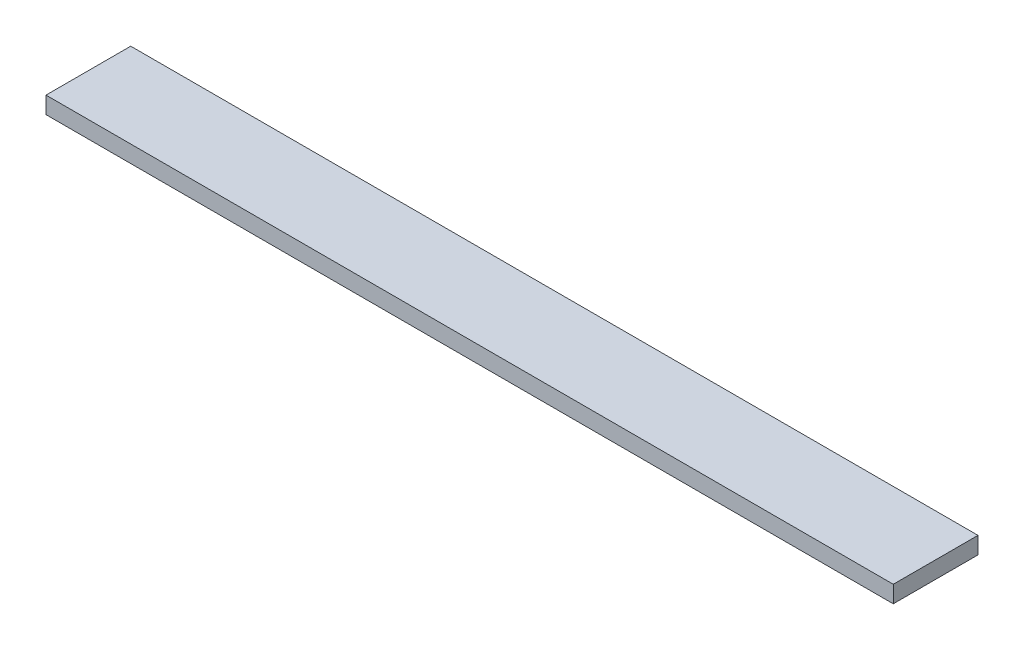
ISO-10303-21;
HEADER;
FILE_DESCRIPTION(('STEP AP214'),'2;1');
FILE_NAME('part.step','',(''),(''),'','','');
FILE_SCHEMA(('AUTOMOTIVE_DESIGN { 1 0 10303 214 1 1 1 1 }'));
ENDSEC;
DATA;
#1=APPLICATION_CONTEXT('core data for automotive mechanical design processes');
#2=APPLICATION_PROTOCOL_DEFINITION('international standard','automotive_design',2000,#1);
#3=PRODUCT_CONTEXT('',#1,'mechanical');
#4=PRODUCT('Part','Part','',(#3));
#5=PRODUCT_RELATED_PRODUCT_CATEGORY('part','',(#4));
#6=PRODUCT_DEFINITION_FORMATION('','',#4);
#7=PRODUCT_DEFINITION_CONTEXT('part definition',#1,'design');
#8=PRODUCT_DEFINITION('design','',#6,#7);
#9=PRODUCT_DEFINITION_SHAPE('','',#8);
#10=(LENGTH_UNIT() NAMED_UNIT(*) SI_UNIT(.MILLI.,.METRE.));
#11=(NAMED_UNIT(*) PLANE_ANGLE_UNIT() SI_UNIT($,.RADIAN.));
#12=(NAMED_UNIT(*) SI_UNIT($,.STERADIAN.) SOLID_ANGLE_UNIT());
#13=UNCERTAINTY_MEASURE_WITH_UNIT(LENGTH_MEASURE(1.E-05),#10,'distance_accuracy_value','');
#14=(GEOMETRIC_REPRESENTATION_CONTEXT(3) GLOBAL_UNCERTAINTY_ASSIGNED_CONTEXT((#13)) GLOBAL_UNIT_ASSIGNED_CONTEXT((#10,
#11,#12)) REPRESENTATION_CONTEXT('',''));
#15=CARTESIAN_POINT('',(0.,0.,0.));
#16=DIRECTION('',(0.,0.,1.));
#17=DIRECTION('',(1.,0.,0.));
#18=AXIS2_PLACEMENT_3D('',#15,#16,#17);
#19=CARTESIAN_POINT('',(200.,0.,0.));
#20=DIRECTION('',(0.,0.,-1.));
#21=DIRECTION('',(-1.,0.,0.));
#22=AXIS2_PLACEMENT_3D('',#19,#20,#21);
#23=PLANE('',#22);
#24=DIRECTION('',(0.,-1.,0.));
#25=VECTOR('',#24,1.);
#26=CARTESIAN_POINT('',(0.,0.,0.));
#27=LINE('',#26,#25);
#28=CARTESIAN_POINT('',(0.,4.,0.));
#29=VERTEX_POINT('',#28);
#30=CARTESIAN_POINT('',(0.,0.,0.));
#31=VERTEX_POINT('',#30);
#32=EDGE_CURVE('E97',#29,#31,#27,.T.);
#33=ORIENTED_EDGE('',*,*,#32,.T.);
#34=DIRECTION('',(-1.,0.,0.));
#35=VECTOR('',#34,1.);
#36=CARTESIAN_POINT('',(200.,0.,0.));
#37=LINE('',#36,#35);
#38=CARTESIAN_POINT('',(200.,0.,0.));
#39=VERTEX_POINT('',#38);
#40=EDGE_CURVE('E11',#39,#31,#37,.T.);
#41=ORIENTED_EDGE('',*,*,#40,.F.);
#42=DIRECTION('',(0.,-1.,0.));
#43=VECTOR('',#42,1.);
#44=CARTESIAN_POINT('',(200.,0.,0.));
#45=LINE('',#44,#43);
#46=CARTESIAN_POINT('',(200.,4.,0.));
#47=VERTEX_POINT('',#46);
#48=EDGE_CURVE('E85',#47,#39,#45,.T.);
#49=ORIENTED_EDGE('',*,*,#48,.F.);
#50=DIRECTION('',(-1.,0.,0.));
#51=VECTOR('',#50,1.);
#52=CARTESIAN_POINT('',(200.,4.,0.));
#53=LINE('',#52,#51);
#54=EDGE_CURVE('E93',#47,#29,#53,.T.);
#55=ORIENTED_EDGE('',*,*,#54,.T.);
#56=EDGE_LOOP('',(#33,#41,#49,#55));
#57=FACE_BOUND('',#56,.T.);
#58=ADVANCED_FACE('F34',(#57),#23,.F.);
#59=CARTESIAN_POINT('',(200.,0.,0.));
#60=DIRECTION('',(0.,1.,0.));
#61=DIRECTION('',(0.,0.,1.));
#62=AXIS2_PLACEMENT_3D('',#59,#60,#61);
#63=PLANE('',#62);
#64=DIRECTION('',(0.,0.,-1.));
#65=VECTOR('',#64,1.);
#66=CARTESIAN_POINT('',(0.,0.,0.));
#67=LINE('',#66,#65);
#68=CARTESIAN_POINT('',(0.,0.,-20.));
#69=VERTEX_POINT('',#68);
#70=EDGE_CURVE('E89',#31,#69,#67,.T.);
#71=ORIENTED_EDGE('',*,*,#70,.T.);
#72=DIRECTION('',(-1.,0.,0.));
#73=VECTOR('',#72,1.);
#74=CARTESIAN_POINT('',(200.,0.,-20.));
#75=LINE('',#74,#73);
#76=CARTESIAN_POINT('',(200.,0.,-20.));
#77=VERTEX_POINT('',#76);
#78=EDGE_CURVE('E42',#77,#69,#75,.T.);
#79=ORIENTED_EDGE('',*,*,#78,.F.);
#80=DIRECTION('',(0.,0.,-1.));
#81=VECTOR('',#80,1.);
#82=CARTESIAN_POINT('',(200.,0.,0.));
#83=LINE('',#82,#81);
#84=EDGE_CURVE('E80',#39,#77,#83,.T.);
#85=ORIENTED_EDGE('',*,*,#84,.F.);
#86=ORIENTED_EDGE('',*,*,#40,.T.);
#87=EDGE_LOOP('',(#71,#79,#85,#86));
#88=FACE_BOUND('',#87,.T.);
#89=ADVANCED_FACE('F88',(#88),#63,.F.);
#90=CARTESIAN_POINT('',(200.,0.,-20.));
#91=DIRECTION('',(0.,0.,1.));
#92=DIRECTION('',(1.,0.,0.));
#93=AXIS2_PLACEMENT_3D('',#90,#91,#92);
#94=PLANE('',#93);
#95=DIRECTION('',(0.,1.,0.));
#96=VECTOR('',#95,1.);
#97=CARTESIAN_POINT('',(0.,0.,-20.));
#98=LINE('',#97,#96);
#99=CARTESIAN_POINT('',(0.,4.,-20.));
#100=VERTEX_POINT('',#99);
#101=EDGE_CURVE('E67',#69,#100,#98,.T.);
#102=ORIENTED_EDGE('',*,*,#101,.T.);
#103=DIRECTION('',(-1.,0.,0.));
#104=VECTOR('',#103,1.);
#105=CARTESIAN_POINT('',(200.,4.,-20.));
#106=LINE('',#105,#104);
#107=CARTESIAN_POINT('',(200.,4.,-20.));
#108=VERTEX_POINT('',#107);
#109=EDGE_CURVE('E90',#108,#100,#106,.T.);
#110=ORIENTED_EDGE('',*,*,#109,.F.);
#111=DIRECTION('',(0.,1.,0.));
#112=VECTOR('',#111,1.);
#113=CARTESIAN_POINT('',(200.,0.,-20.));
#114=LINE('',#113,#112);
#115=EDGE_CURVE('E83',#77,#108,#114,.T.);
#116=ORIENTED_EDGE('',*,*,#115,.F.);
#117=ORIENTED_EDGE('',*,*,#78,.T.);
#118=EDGE_LOOP('',(#102,#110,#116,#117));
#119=FACE_BOUND('',#118,.T.);
#120=ADVANCED_FACE('F91',(#119),#94,.F.);
#121=CARTESIAN_POINT('',(200.,4.,0.));
#122=DIRECTION('',(0.,-1.,0.));
#123=DIRECTION('',(0.,0.,-1.));
#124=AXIS2_PLACEMENT_3D('',#121,#122,#123);
#125=PLANE('',#124);
#126=DIRECTION('',(0.,0.,1.));
#127=VECTOR('',#126,1.);
#128=CARTESIAN_POINT('',(0.,4.,0.));
#129=LINE('',#128,#127);
#130=EDGE_CURVE('E73',#100,#29,#129,.T.);
#131=ORIENTED_EDGE('',*,*,#130,.T.);
#132=ORIENTED_EDGE('',*,*,#54,.F.);
#133=DIRECTION('',(0.,0.,1.));
#134=VECTOR('',#133,1.);
#135=CARTESIAN_POINT('',(200.,4.,0.));
#136=LINE('',#135,#134);
#137=EDGE_CURVE('E50',#108,#47,#136,.T.);
#138=ORIENTED_EDGE('',*,*,#137,.F.);
#139=ORIENTED_EDGE('',*,*,#109,.T.);
#140=EDGE_LOOP('',(#131,#132,#138,#139));
#141=FACE_BOUND('',#140,.T.);
#142=ADVANCED_FACE('F104',(#141),#125,.F.);
#143=CARTESIAN_POINT('',(200.,0.,0.));
#144=DIRECTION('',(-1.,0.,0.));
#145=DIRECTION('',(0.,0.,1.));
#146=AXIS2_PLACEMENT_3D('',#143,#144,#145);
#147=PLANE('',#146);
#148=ORIENTED_EDGE('',*,*,#48,.T.);
#149=ORIENTED_EDGE('',*,*,#84,.T.);
#150=ORIENTED_EDGE('',*,*,#115,.T.);
#151=ORIENTED_EDGE('',*,*,#137,.T.);
#152=EDGE_LOOP('',(#148,#149,#150,#151));
#153=FACE_BOUND('',#152,.T.);
#154=ADVANCED_FACE('F81',(#153),#147,.F.);
#155=CARTESIAN_POINT('',(0.,0.,0.));
#156=DIRECTION('',(-1.,0.,0.));
#157=DIRECTION('',(0.,0.,1.));
#158=AXIS2_PLACEMENT_3D('',#155,#156,#157);
#159=PLANE('',#158);
#160=ORIENTED_EDGE('',*,*,#32,.F.);
#161=ORIENTED_EDGE('',*,*,#130,.F.);
#162=ORIENTED_EDGE('',*,*,#101,.F.);
#163=ORIENTED_EDGE('',*,*,#70,.F.);
#164=EDGE_LOOP('',(#160,#161,#162,#163));
#165=FACE_BOUND('',#164,.T.);
#166=ADVANCED_FACE('F107',(#165),#159,.T.);
#167=CLOSED_SHELL('',(#58,#89,#120,#142,#154,#166));
#168=MANIFOLD_SOLID_BREP('B2',#167);
#169=ADVANCED_BREP_SHAPE_REPRESENTATION('',(#18,#168),#14);
#170=SHAPE_DEFINITION_REPRESENTATION(#9,#169);
ENDSEC;
END-ISO-10303-21;
